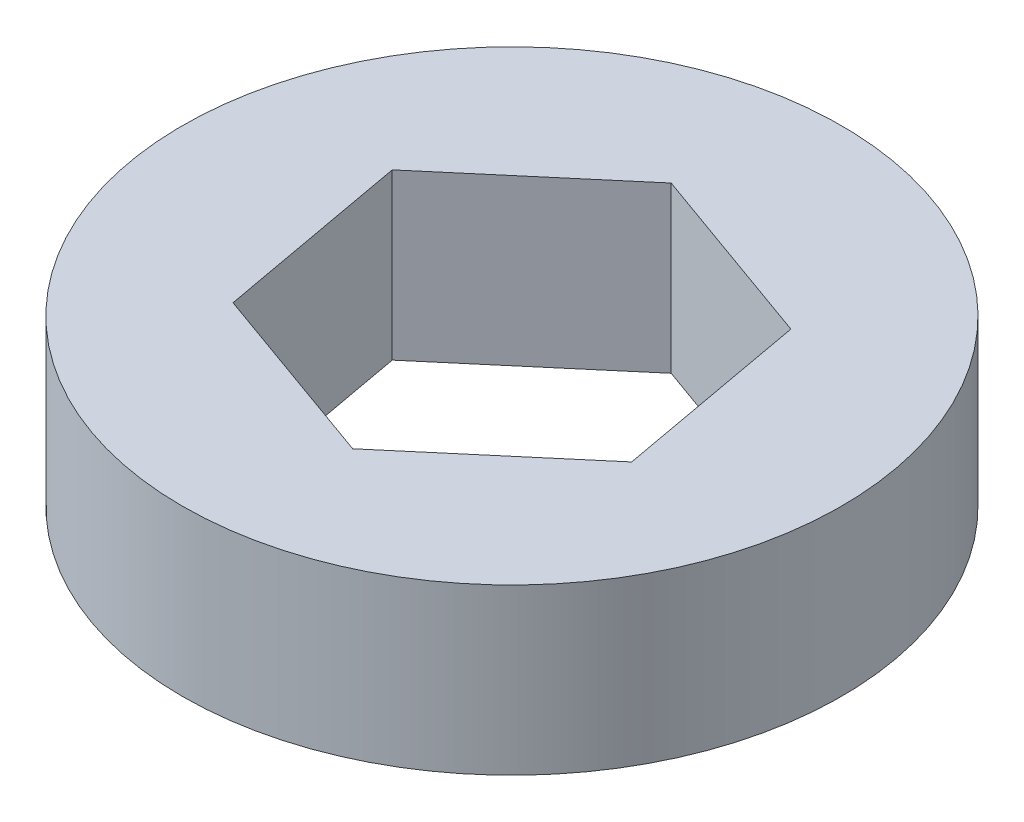
ISO-10303-21;
HEADER;
FILE_DESCRIPTION(('STEP AP214'),'2;1');
FILE_NAME('part.step','',(''),(''),'','','');
FILE_SCHEMA(('AUTOMOTIVE_DESIGN { 1 0 10303 214 1 1 1 1 }'));
ENDSEC;
DATA;
#1=APPLICATION_CONTEXT('core data for automotive mechanical design processes');
#2=APPLICATION_PROTOCOL_DEFINITION('international standard','automotive_design',2000,#1);
#3=PRODUCT_CONTEXT('',#1,'mechanical');
#4=PRODUCT('Part','Part','',(#3));
#5=PRODUCT_RELATED_PRODUCT_CATEGORY('part','',(#4));
#6=PRODUCT_DEFINITION_FORMATION('','',#4);
#7=PRODUCT_DEFINITION_CONTEXT('part definition',#1,'design');
#8=PRODUCT_DEFINITION('design','',#6,#7);
#9=PRODUCT_DEFINITION_SHAPE('','',#8);
#10=(LENGTH_UNIT() NAMED_UNIT(*) SI_UNIT(.MILLI.,.METRE.));
#11=(NAMED_UNIT(*) PLANE_ANGLE_UNIT() SI_UNIT($,.RADIAN.));
#12=(NAMED_UNIT(*) SI_UNIT($,.STERADIAN.) SOLID_ANGLE_UNIT());
#13=UNCERTAINTY_MEASURE_WITH_UNIT(LENGTH_MEASURE(1.E-05),#10,'distance_accuracy_value','');
#14=(GEOMETRIC_REPRESENTATION_CONTEXT(3) GLOBAL_UNCERTAINTY_ASSIGNED_CONTEXT((#13)) GLOBAL_UNIT_ASSIGNED_CONTEXT((#10,
#11,#12)) REPRESENTATION_CONTEXT('',''));
#15=CARTESIAN_POINT('',(0.,0.,0.));
#16=DIRECTION('',(0.,0.,1.));
#17=DIRECTION('',(1.,0.,0.));
#18=AXIS2_PLACEMENT_3D('',#15,#16,#17);
#19=CARTESIAN_POINT('',(0.,6.35,0.));
#20=DIRECTION('',(0.,1.,0.));
#21=DIRECTION('',(0.,0.,1.));
#22=AXIS2_PLACEMENT_3D('',#19,#20,#21);
#23=PLANE('',#22);
#24=CARTESIAN_POINT('',(0.,6.35,0.));
#25=DIRECTION('',(0.,1.,0.));
#26=DIRECTION('',(0.,0.,1.));
#27=AXIS2_PLACEMENT_3D('',#24,#25,#26);
#28=CIRCLE('',#27,12.7);
#29=CARTESIAN_POINT('',(0.,6.35,12.7));
#30=VERTEX_POINT('',#29);
#31=EDGE_CURVE('E11',#30,#30,#28,.T.);
#32=ORIENTED_EDGE('',*,*,#31,.T.);
#33=EDGE_LOOP('',(#32));
#34=FACE_BOUND('',#33,.T.);
#35=DIRECTION('',(-0.76242016425633,0.,0.647082292398232));
#36=VECTOR('',#35,1.);
#37=CARTESIAN_POINT('',(-1.36635971039431,6.35,-7.50223183293775));
#38=LINE('',#37,#36);
#39=CARTESIAN_POINT('',(-1.36635971039431,6.35,-7.50223183293775));
#40=VERTEX_POINT('',#39);
#41=CARTESIAN_POINT('',(-7.18030320760154,6.35,-2.56781369655986));
#42=VERTEX_POINT('',#41);
#43=EDGE_CURVE('E97',#40,#42,#38,.T.);
#44=ORIENTED_EDGE('',*,*,#43,.F.);
#45=DIRECTION('',(-0.941599785684104,0.,-0.336734084404371));
#46=VECTOR('',#45,1.);
#47=CARTESIAN_POINT('',(5.81394349720723,6.35,-4.93441813637789));
#48=LINE('',#47,#46);
#49=CARTESIAN_POINT('',(5.81394349720723,6.35,-4.93441813637789));
#50=VERTEX_POINT('',#49);
#51=EDGE_CURVE('E104',#50,#40,#48,.T.);
#52=ORIENTED_EDGE('',*,*,#51,.F.);
#53=DIRECTION('',(-0.179179621427773,0.,-0.983816376802602));
#54=VECTOR('',#53,1.);
#55=CARTESIAN_POINT('',(7.18030320760154,6.35,2.56781369655986));
#56=LINE('',#55,#54);
#57=CARTESIAN_POINT('',(7.18030320760154,6.35,2.56781369655986));
#58=VERTEX_POINT('',#57);
#59=EDGE_CURVE('E111',#58,#50,#56,.T.);
#60=ORIENTED_EDGE('',*,*,#59,.F.);
#61=DIRECTION('',(0.76242016425633,0.,-0.647082292398232));
#62=VECTOR('',#61,1.);
#63=CARTESIAN_POINT('',(1.3663597103943,6.35,7.50223183293775));
#64=LINE('',#63,#62);
#65=CARTESIAN_POINT('',(1.3663597103943,6.35,7.50223183293775));
#66=VERTEX_POINT('',#65);
#67=EDGE_CURVE('E55',#66,#58,#64,.T.);
#68=ORIENTED_EDGE('',*,*,#67,.F.);
#69=DIRECTION('',(0.941599785684104,0.,0.336734084404371));
#70=VECTOR('',#69,1.);
#71=CARTESIAN_POINT('',(-5.81394349720723,6.35,4.93441813637789));
#72=LINE('',#71,#70);
#73=CARTESIAN_POINT('',(-5.81394349720723,6.35,4.93441813637789));
#74=VERTEX_POINT('',#73);
#75=EDGE_CURVE('E119',#74,#66,#72,.T.);
#76=ORIENTED_EDGE('',*,*,#75,.F.);
#77=DIRECTION('',(0.179179621427774,0.,0.983816376802602));
#78=VECTOR('',#77,1.);
#79=CARTESIAN_POINT('',(-7.18030320760154,6.35,-2.56781369655986));
#80=LINE('',#79,#78);
#81=EDGE_CURVE('E115',#42,#74,#80,.T.);
#82=ORIENTED_EDGE('',*,*,#81,.F.);
#83=EDGE_LOOP('',(#44,#52,#60,#68,#76,#82));
#84=FACE_BOUND('',#83,.T.);
#85=ADVANCED_FACE('F39',(#34,#84),#23,.T.);
#86=CARTESIAN_POINT('',(0.,0.,0.));
#87=DIRECTION('',(0.,1.,0.));
#88=DIRECTION('',(0.,0.,1.));
#89=AXIS2_PLACEMENT_3D('',#86,#87,#88);
#90=PLANE('',#89);
#91=CARTESIAN_POINT('',(0.,0.,0.));
#92=DIRECTION('',(0.,1.,0.));
#93=DIRECTION('',(0.,0.,1.));
#94=AXIS2_PLACEMENT_3D('',#91,#92,#93);
#95=CIRCLE('',#94,12.7);
#96=CARTESIAN_POINT('',(0.,0.,12.7));
#97=VERTEX_POINT('',#96);
#98=EDGE_CURVE('E43',#97,#97,#95,.T.);
#99=ORIENTED_EDGE('',*,*,#98,.F.);
#100=EDGE_LOOP('',(#99));
#101=FACE_BOUND('',#100,.T.);
#102=DIRECTION('',(-0.941599785684104,0.,-0.336734084404371));
#103=VECTOR('',#102,1.);
#104=CARTESIAN_POINT('',(5.81394349720723,0.,-4.93441813637789));
#105=LINE('',#104,#103);
#106=CARTESIAN_POINT('',(5.81394349720723,0.,-4.93441813637789));
#107=VERTEX_POINT('',#106);
#108=CARTESIAN_POINT('',(-1.36635971039431,0.,-7.50223183293775));
#109=VERTEX_POINT('',#108);
#110=EDGE_CURVE('E63',#107,#109,#105,.T.);
#111=ORIENTED_EDGE('',*,*,#110,.T.);
#112=DIRECTION('',(-0.76242016425633,0.,0.647082292398232));
#113=VECTOR('',#112,1.);
#114=CARTESIAN_POINT('',(-1.36635971039431,0.,-7.50223183293775));
#115=LINE('',#114,#113);
#116=CARTESIAN_POINT('',(-7.18030320760154,0.,-2.56781369655986));
#117=VERTEX_POINT('',#116);
#118=EDGE_CURVE('E100',#109,#117,#115,.T.);
#119=ORIENTED_EDGE('',*,*,#118,.T.);
#120=DIRECTION('',(0.179179621427774,0.,0.983816376802602));
#121=VECTOR('',#120,1.);
#122=CARTESIAN_POINT('',(-7.18030320760154,0.,-2.56781369655986));
#123=LINE('',#122,#121);
#124=CARTESIAN_POINT('',(-5.81394349720723,0.,4.93441813637789));
#125=VERTEX_POINT('',#124);
#126=EDGE_CURVE('E129',#117,#125,#123,.T.);
#127=ORIENTED_EDGE('',*,*,#126,.T.);
#128=DIRECTION('',(0.941599785684104,0.,0.336734084404371));
#129=VECTOR('',#128,1.);
#130=CARTESIAN_POINT('',(-5.81394349720723,0.,4.93441813637789));
#131=LINE('',#130,#129);
#132=CARTESIAN_POINT('',(1.3663597103943,0.,7.50223183293775));
#133=VERTEX_POINT('',#132);
#134=EDGE_CURVE('E133',#125,#133,#131,.T.);
#135=ORIENTED_EDGE('',*,*,#134,.T.);
#136=DIRECTION('',(0.76242016425633,0.,-0.647082292398232));
#137=VECTOR('',#136,1.);
#138=CARTESIAN_POINT('',(1.3663597103943,0.,7.50223183293775));
#139=LINE('',#138,#137);
#140=CARTESIAN_POINT('',(7.18030320760154,0.,2.56781369655986));
#141=VERTEX_POINT('',#140);
#142=EDGE_CURVE('E137',#133,#141,#139,.T.);
#143=ORIENTED_EDGE('',*,*,#142,.T.);
#144=DIRECTION('',(-0.179179621427773,0.,-0.983816376802602));
#145=VECTOR('',#144,1.);
#146=CARTESIAN_POINT('',(7.18030320760154,0.,2.56781369655986));
#147=LINE('',#146,#145);
#148=EDGE_CURVE('E124',#141,#107,#147,.T.);
#149=ORIENTED_EDGE('',*,*,#148,.T.);
#150=EDGE_LOOP('',(#111,#119,#127,#135,#143,#149));
#151=FACE_BOUND('',#150,.T.);
#152=ADVANCED_FACE('F165',(#101,#151),#90,.F.);
#153=CARTESIAN_POINT('',(0.,6.35,0.));
#154=DIRECTION('',(0.,-1.,0.));
#155=DIRECTION('',(0.,0.,-1.));
#156=AXIS2_PLACEMENT_3D('',#153,#154,#155);
#157=CYLINDRICAL_SURFACE('',#156,12.7);
#158=ORIENTED_EDGE('',*,*,#31,.F.);
#159=EDGE_LOOP('',(#158));
#160=FACE_BOUND('',#159,.T.);
#161=ORIENTED_EDGE('',*,*,#98,.T.);
#162=EDGE_LOOP('',(#161));
#163=FACE_BOUND('',#162,.T.);
#164=ADVANCED_FACE('F41',(#160,#163),#157,.T.);
#165=CARTESIAN_POINT('',(5.81394349720723,27.1192307636308,-4.93441813637789));
#166=DIRECTION('',(-0.336734084404371,0.,0.941599785684104));
#167=DIRECTION('',(0.941599785684104,0.,0.336734084404371));
#168=AXIS2_PLACEMENT_3D('',#165,#166,#167);
#169=PLANE('',#168);
#170=ORIENTED_EDGE('',*,*,#51,.T.);
#171=DIRECTION('',(0.,-1.,0.));
#172=VECTOR('',#171,1.);
#173=CARTESIAN_POINT('',(-1.36635971039431,27.1192307636308,-7.50223183293775));
#174=LINE('',#173,#172);
#175=EDGE_CURVE('E93',#40,#109,#174,.T.);
#176=ORIENTED_EDGE('',*,*,#175,.T.);
#177=ORIENTED_EDGE('',*,*,#110,.F.);
#178=DIRECTION('',(0.,-1.,0.));
#179=VECTOR('',#178,1.);
#180=CARTESIAN_POINT('',(5.81394349720723,27.1192307636308,-4.93441813637789));
#181=LINE('',#180,#179);
#182=EDGE_CURVE('E106',#50,#107,#181,.T.);
#183=ORIENTED_EDGE('',*,*,#182,.F.);
#184=EDGE_LOOP('',(#170,#176,#177,#183));
#185=FACE_BOUND('',#184,.T.);
#186=ADVANCED_FACE('F105',(#185),#169,.T.);
#187=CARTESIAN_POINT('',(-1.36635971039431,27.1192307636308,-7.50223183293775));
#188=DIRECTION('',(0.647082292398232,0.,0.76242016425633));
#189=DIRECTION('',(0.76242016425633,0.,-0.647082292398232));
#190=AXIS2_PLACEMENT_3D('',#187,#188,#189);
#191=PLANE('',#190);
#192=ORIENTED_EDGE('',*,*,#43,.T.);
#193=DIRECTION('',(0.,-1.,0.));
#194=VECTOR('',#193,1.);
#195=CARTESIAN_POINT('',(-7.18030320760154,27.1192307636308,-2.56781369655986));
#196=LINE('',#195,#194);
#197=EDGE_CURVE('E126',#42,#117,#196,.T.);
#198=ORIENTED_EDGE('',*,*,#197,.T.);
#199=ORIENTED_EDGE('',*,*,#118,.F.);
#200=ORIENTED_EDGE('',*,*,#175,.F.);
#201=EDGE_LOOP('',(#192,#198,#199,#200));
#202=FACE_BOUND('',#201,.T.);
#203=ADVANCED_FACE('F95',(#202),#191,.T.);
#204=CARTESIAN_POINT('',(-7.18030320760154,27.1192307636308,-2.56781369655986));
#205=DIRECTION('',(0.983816376802602,0.,-0.179179621427774));
#206=DIRECTION('',(-0.179179621427774,0.,-0.983816376802602));
#207=AXIS2_PLACEMENT_3D('',#204,#205,#206);
#208=PLANE('',#207);
#209=ORIENTED_EDGE('',*,*,#81,.T.);
#210=DIRECTION('',(0.,-1.,0.));
#211=VECTOR('',#210,1.);
#212=CARTESIAN_POINT('',(-5.81394349720723,27.1192307636308,4.93441813637789));
#213=LINE('',#212,#211);
#214=EDGE_CURVE('E130',#74,#125,#213,.T.);
#215=ORIENTED_EDGE('',*,*,#214,.T.);
#216=ORIENTED_EDGE('',*,*,#126,.F.);
#217=ORIENTED_EDGE('',*,*,#197,.F.);
#218=EDGE_LOOP('',(#209,#215,#216,#217));
#219=FACE_BOUND('',#218,.T.);
#220=ADVANCED_FACE('F174',(#219),#208,.T.);
#221=CARTESIAN_POINT('',(-5.81394349720723,27.1192307636308,4.93441813637789));
#222=DIRECTION('',(0.336734084404371,0.,-0.941599785684104));
#223=DIRECTION('',(-0.941599785684104,0.,-0.336734084404371));
#224=AXIS2_PLACEMENT_3D('',#221,#222,#223);
#225=PLANE('',#224);
#226=ORIENTED_EDGE('',*,*,#75,.T.);
#227=DIRECTION('',(0.,-1.,0.));
#228=VECTOR('',#227,1.);
#229=CARTESIAN_POINT('',(1.3663597103943,27.1192307636308,7.50223183293775));
#230=LINE('',#229,#228);
#231=EDGE_CURVE('E134',#66,#133,#230,.T.);
#232=ORIENTED_EDGE('',*,*,#231,.T.);
#233=ORIENTED_EDGE('',*,*,#134,.F.);
#234=ORIENTED_EDGE('',*,*,#214,.F.);
#235=EDGE_LOOP('',(#226,#232,#233,#234));
#236=FACE_BOUND('',#235,.T.);
#237=ADVANCED_FACE('F155',(#236),#225,.T.);
#238=CARTESIAN_POINT('',(1.3663597103943,27.1192307636308,7.50223183293775));
#239=DIRECTION('',(-0.647082292398232,0.,-0.76242016425633));
#240=DIRECTION('',(-0.76242016425633,0.,0.647082292398232));
#241=AXIS2_PLACEMENT_3D('',#238,#239,#240);
#242=PLANE('',#241);
#243=ORIENTED_EDGE('',*,*,#67,.T.);
#244=DIRECTION('',(0.,-1.,0.));
#245=VECTOR('',#244,1.);
#246=CARTESIAN_POINT('',(7.18030320760154,27.1192307636308,2.56781369655986));
#247=LINE('',#246,#245);
#248=EDGE_CURVE('E138',#58,#141,#247,.T.);
#249=ORIENTED_EDGE('',*,*,#248,.T.);
#250=ORIENTED_EDGE('',*,*,#142,.F.);
#251=ORIENTED_EDGE('',*,*,#231,.F.);
#252=EDGE_LOOP('',(#243,#249,#250,#251));
#253=FACE_BOUND('',#252,.T.);
#254=ADVANCED_FACE('F160',(#253),#242,.T.);
#255=CARTESIAN_POINT('',(7.18030320760154,27.1192307636308,2.56781369655986));
#256=DIRECTION('',(-0.983816376802602,0.,0.179179621427773));
#257=DIRECTION('',(0.179179621427773,0.,0.983816376802602));
#258=AXIS2_PLACEMENT_3D('',#255,#256,#257);
#259=PLANE('',#258);
#260=ORIENTED_EDGE('',*,*,#59,.T.);
#261=ORIENTED_EDGE('',*,*,#182,.T.);
#262=ORIENTED_EDGE('',*,*,#148,.F.);
#263=ORIENTED_EDGE('',*,*,#248,.F.);
#264=EDGE_LOOP('',(#260,#261,#262,#263));
#265=FACE_BOUND('',#264,.T.);
#266=ADVANCED_FACE('F158',(#265),#259,.T.);
#267=CLOSED_SHELL('',(#85,#152,#164,#186,#203,#220,#237,#254,#266));
#268=MANIFOLD_SOLID_BREP('B2',#267);
#269=ADVANCED_BREP_SHAPE_REPRESENTATION('',(#18,#268),#14);
#270=SHAPE_DEFINITION_REPRESENTATION(#9,#269);
ENDSEC;
END-ISO-10303-21;
